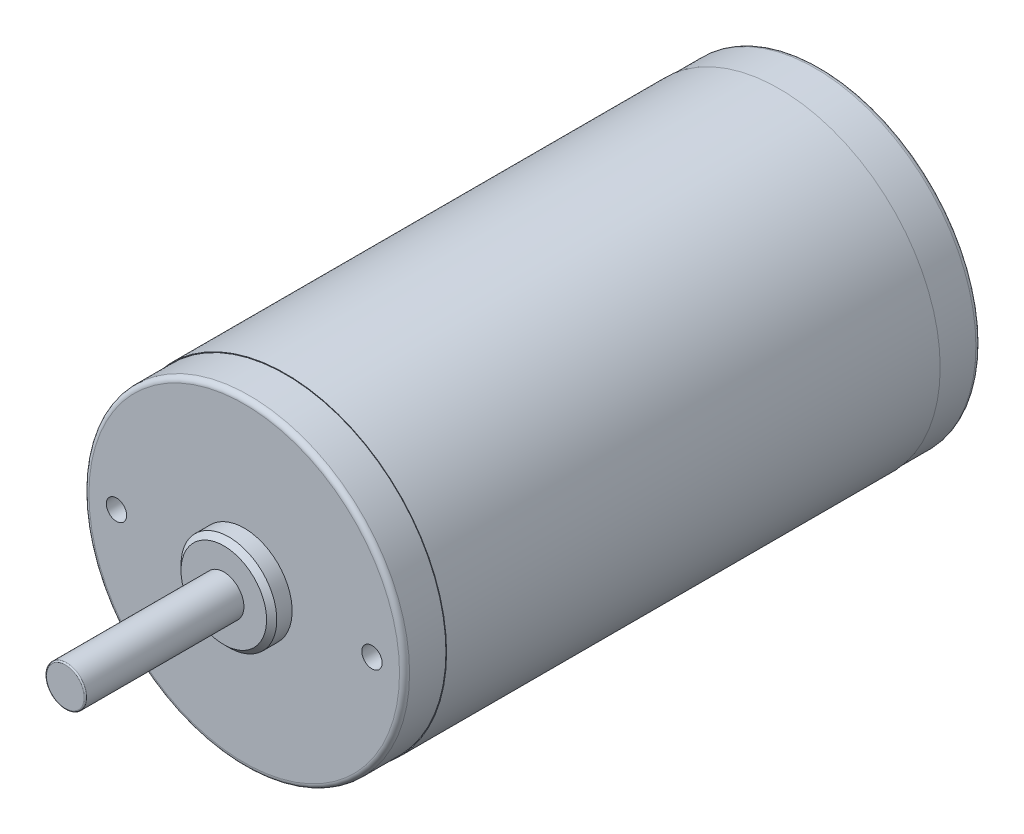
ISO-10303-21;
HEADER;
FILE_DESCRIPTION(('STEP AP214'),'2;1');
FILE_NAME('part.step','',(''),(''),'','','');
FILE_SCHEMA(('AUTOMOTIVE_DESIGN { 1 0 10303 214 1 1 1 1 }'));
ENDSEC;
DATA;
#1=APPLICATION_CONTEXT('core data for automotive mechanical design processes');
#2=APPLICATION_PROTOCOL_DEFINITION('international standard','automotive_design',2000,#1);
#3=PRODUCT_CONTEXT('',#1,'mechanical');
#4=PRODUCT('Part','Part','',(#3));
#5=PRODUCT_RELATED_PRODUCT_CATEGORY('part','',(#4));
#6=PRODUCT_DEFINITION_FORMATION('','',#4);
#7=PRODUCT_DEFINITION_CONTEXT('part definition',#1,'design');
#8=PRODUCT_DEFINITION('design','',#6,#7);
#9=PRODUCT_DEFINITION_SHAPE('','',#8);
#10=(LENGTH_UNIT() NAMED_UNIT(*) SI_UNIT(.MILLI.,.METRE.));
#11=(NAMED_UNIT(*) PLANE_ANGLE_UNIT() SI_UNIT($,.RADIAN.));
#12=(NAMED_UNIT(*) SI_UNIT($,.STERADIAN.) SOLID_ANGLE_UNIT());
#13=UNCERTAINTY_MEASURE_WITH_UNIT(LENGTH_MEASURE(1.E-05),#10,'distance_accuracy_value','');
#14=(GEOMETRIC_REPRESENTATION_CONTEXT(3) GLOBAL_UNCERTAINTY_ASSIGNED_CONTEXT((#13)) GLOBAL_UNIT_ASSIGNED_CONTEXT((#10,
#11,#12)) REPRESENTATION_CONTEXT('',''));
#15=CARTESIAN_POINT('',(0.,0.,0.));
#16=DIRECTION('',(0.,0.,1.));
#17=DIRECTION('',(1.,0.,0.));
#18=AXIS2_PLACEMENT_3D('',#15,#16,#17);
#19=CARTESIAN_POINT('',(35.56,109.2962,54.614));
#20=DIRECTION('',(0.,0.,1.));
#21=DIRECTION('',(1.,0.,0.));
#22=AXIS2_PLACEMENT_3D('',#19,#20,#21);
#23=PLANE('',#22);
#24=CARTESIAN_POINT('',(35.56,109.2962,54.614));
#25=DIRECTION('',(0.,0.,-1.));
#26=DIRECTION('',(-1.,0.,0.));
#27=AXIS2_PLACEMENT_3D('',#24,#25,#26);
#28=CIRCLE('',#27,3.74600000000008);
#29=CARTESIAN_POINT('',(31.8139999999999,109.2962,54.614));
#30=VERTEX_POINT('',#29);
#31=CARTESIAN_POINT('',(39.3060000000001,109.2962,54.614));
#32=VERTEX_POINT('',#31);
#33=EDGE_CURVE('E67',#30,#32,#28,.T.);
#34=ORIENTED_EDGE('',*,*,#33,.F.);
#35=CARTESIAN_POINT('',(35.56,109.2962,54.614));
#36=DIRECTION('',(0.,0.,-1.));
#37=DIRECTION('',(1.,0.,0.));
#38=AXIS2_PLACEMENT_3D('',#35,#36,#37);
#39=CIRCLE('',#38,3.74600000000008);
#40=EDGE_CURVE('E63',#32,#30,#39,.T.);
#41=ORIENTED_EDGE('',*,*,#40,.F.);
#42=EDGE_LOOP('',(#34,#41));
#43=FACE_BOUND('',#42,.T.);
#44=ADVANCED_FACE('F17',(#43),#23,.T.);
#45=CARTESIAN_POINT('',(35.56,109.2962,54.36));
#46=DIRECTION('',(0.,0.,1.));
#47=DIRECTION('',(1.,0.,0.));
#48=AXIS2_PLACEMENT_3D('',#45,#46,#47);
#49=TOROIDAL_SURFACE('',#48,3.74600000000008,0.254);
#50=ORIENTED_EDGE('',*,*,#40,.T.);
#51=ORIENTED_EDGE('',*,*,#33,.T.);
#52=EDGE_LOOP('',(#50,#51));
#53=FACE_BOUND('',#52,.T.);
#54=CARTESIAN_POINT('',(35.56,109.2962,54.36));
#55=DIRECTION('',(0.,0.,-1.));
#56=DIRECTION('',(-1.,0.,0.));
#57=AXIS2_PLACEMENT_3D('',#54,#55,#56);
#58=CIRCLE('',#57,4.00000000000007);
#59=CARTESIAN_POINT('',(31.5599999999999,109.2962,54.36));
#60=VERTEX_POINT('',#59);
#61=EDGE_CURVE('E74',#60,#60,#58,.T.);
#62=ORIENTED_EDGE('',*,*,#61,.F.);
#63=EDGE_LOOP('',(#62));
#64=FACE_BOUND('',#63,.T.);
#65=ADVANCED_FACE('F72',(#53,#64),#49,.T.);
#66=CARTESIAN_POINT('',(35.56,109.2962,54.614));
#67=DIRECTION('',(0.,0.,-1.));
#68=DIRECTION('',(-1.,0.,0.));
#69=AXIS2_PLACEMENT_3D('',#66,#67,#68);
#70=CYLINDRICAL_SURFACE('',#69,4.00000000000007);
#71=CARTESIAN_POINT('',(35.56,109.2962,23.114));
#72=DIRECTION('',(0.,0.,-1.));
#73=DIRECTION('',(-1.,0.,0.));
#74=AXIS2_PLACEMENT_3D('',#71,#72,#73);
#75=CIRCLE('',#74,4.00000000000007);
#76=CARTESIAN_POINT('',(31.5599999999999,109.2962,23.114));
#77=VERTEX_POINT('',#76);
#78=EDGE_CURVE('E104',#77,#77,#75,.T.);
#79=ORIENTED_EDGE('',*,*,#78,.F.);
#80=EDGE_LOOP('',(#79));
#81=FACE_BOUND('',#80,.T.);
#82=ORIENTED_EDGE('',*,*,#61,.T.);
#83=EDGE_LOOP('',(#82));
#84=FACE_BOUND('',#83,.T.);
#85=ADVANCED_FACE('F90',(#81,#84),#70,.T.);
#86=CARTESIAN_POINT('',(35.56,109.2962,23.114));
#87=DIRECTION('',(0.,0.,1.));
#88=DIRECTION('',(1.,0.,0.));
#89=AXIS2_PLACEMENT_3D('',#86,#87,#88);
#90=PLANE('',#89);
#91=ORIENTED_EDGE('',*,*,#78,.T.);
#92=EDGE_LOOP('',(#91));
#93=FACE_BOUND('',#92,.T.);
#94=CARTESIAN_POINT('',(35.56,109.2962,23.114));
#95=DIRECTION('',(0.,0.,-1.));
#96=DIRECTION('',(-1.,0.,0.));
#97=AXIS2_PLACEMENT_3D('',#94,#95,#96);
#98=CIRCLE('',#97,8.50900000182338);
#99=CARTESIAN_POINT('',(27.0509999981766,109.2962,23.114));
#100=VERTEX_POINT('',#99);
#101=EDGE_CURVE('E307',#100,#100,#98,.T.);
#102=ORIENTED_EDGE('',*,*,#101,.F.);
#103=EDGE_LOOP('',(#102));
#104=FACE_BOUND('',#103,.T.);
#105=ADVANCED_FACE('F160',(#93,#104),#90,.T.);
#106=CARTESIAN_POINT('',(35.56,109.2962,-100.317299999998));
#107=DIRECTION('',(0.,0.,-1.));
#108=DIRECTION('',(-1.,0.,0.));
#109=AXIS2_PLACEMENT_3D('',#106,#107,#108);
#110=PLANE('',#109);
#111=CARTESIAN_POINT('',(35.56,109.2962,-100.317299999998));
#112=DIRECTION('',(0.,0.,1.));
#113=DIRECTION('',(1.,0.,0.));
#114=AXIS2_PLACEMENT_3D('',#111,#112,#113);
#115=CIRCLE('',#114,14.0368000000003);
#116=CARTESIAN_POINT('',(49.5968000000003,109.2962,-100.317299999998));
#117=VERTEX_POINT('',#116);
#118=CARTESIAN_POINT('',(21.5231999999997,109.2962,-100.317299999998));
#119=VERTEX_POINT('',#118);
#120=EDGE_CURVE('E142',#117,#119,#115,.T.);
#121=ORIENTED_EDGE('',*,*,#120,.F.);
#122=CARTESIAN_POINT('',(35.56,109.2962,-100.317299999998));
#123=DIRECTION('',(0.,0.,1.));
#124=DIRECTION('',(-1.,0.,0.));
#125=AXIS2_PLACEMENT_3D('',#122,#123,#124);
#126=CIRCLE('',#125,14.0368000000003);
#127=EDGE_CURVE('E310',#119,#117,#126,.T.);
#128=ORIENTED_EDGE('',*,*,#127,.F.);
#129=EDGE_LOOP('',(#121,#128));
#130=FACE_BOUND('',#129,.T.);
#131=ADVANCED_FACE('F150',(#130),#110,.T.);
#132=CARTESIAN_POINT('',(10.1599999999994,109.2962,5.43560000011212));
#133=DIRECTION('',(0.,0.,1.));
#134=DIRECTION('',(1.,0.,0.));
#135=AXIS2_PLACEMENT_3D('',#132,#133,#134);
#136=CONICAL_SURFACE('',#135,2.01930000012817,1.02974425747654);
#137=CARTESIAN_POINT('',(10.1600000000133,109.2962,4.22228214875986));
#138=VERTEX_POINT('',#137);
#139=VERTEX_LOOP('',#138);
#140=FACE_BOUND('',#139,.T.);
#141=CARTESIAN_POINT('',(10.1599999999994,109.2962,5.4356000000007));
#142=DIRECTION('',(0.,0.,1.));
#143=DIRECTION('',(1.,0.,0.));
#144=AXIS2_PLACEMENT_3D('',#141,#142,#143);
#145=CIRCLE('',#144,2.01930000000003);
#146=CARTESIAN_POINT('',(12.1792999999994,109.2962,5.4356000000007));
#147=VERTEX_POINT('',#146);
#148=EDGE_CURVE('E139',#147,#147,#145,.T.);
#149=ORIENTED_EDGE('',*,*,#148,.T.);
#150=EDGE_LOOP('',(#149));
#151=FACE_BOUND('',#150,.T.);
#152=ADVANCED_FACE('F159',(#140,#151),#136,.F.);
#153=CARTESIAN_POINT('',(60.96,109.2962,5.43559999988474));
#154=DIRECTION('',(0.,0.,1.));
#155=DIRECTION('',(1.,0.,0.));
#156=AXIS2_PLACEMENT_3D('',#153,#154,#155);
#157=CONICAL_SURFACE('',#156,2.01929999982444,1.02974425737049);
#158=CARTESIAN_POINT('',(60.9599999997386,109.2962,4.22228214867459));
#159=VERTEX_POINT('',#158);
#160=VERTEX_LOOP('',#159);
#161=FACE_BOUND('',#160,.T.);
#162=CARTESIAN_POINT('',(60.96,109.2962,5.43560000000074));
#163=DIRECTION('',(0.,0.,1.));
#164=DIRECTION('',(1.,0.,0.));
#165=AXIS2_PLACEMENT_3D('',#162,#163,#164);
#166=CIRCLE('',#165,2.01930000000003);
#167=CARTESIAN_POINT('',(62.9793,109.2962,5.43560000000074));
#168=VERTEX_POINT('',#167);
#169=EDGE_CURVE('E136',#168,#168,#166,.T.);
#170=ORIENTED_EDGE('',*,*,#169,.T.);
#171=EDGE_LOOP('',(#170));
#172=FACE_BOUND('',#171,.T.);
#173=ADVANCED_FACE('F363',(#161,#172),#157,.F.);
#174=CARTESIAN_POINT('',(35.56,109.2962,22.0979999999996));
#175=DIRECTION('',(0.,0.,-1.));
#176=DIRECTION('',(-1.,0.,0.));
#177=AXIS2_PLACEMENT_3D('',#174,#175,#176);
#178=CONICAL_SURFACE('',#177,9.52500000000019,0.785398162500005);
#179=CARTESIAN_POINT('',(35.56,109.2962,22.0979999999996));
#180=DIRECTION('',(0.,0.,-1.));
#181=DIRECTION('',(-1.,0.,0.));
#182=AXIS2_PLACEMENT_3D('',#179,#180,#181);
#183=CIRCLE('',#182,9.52500000000019);
#184=CARTESIAN_POINT('',(26.0349999999998,109.2962,22.0979999999996));
#185=VERTEX_POINT('',#184);
#186=EDGE_CURVE('E133',#185,#185,#183,.T.);
#187=ORIENTED_EDGE('',*,*,#186,.F.);
#188=EDGE_LOOP('',(#187));
#189=FACE_BOUND('',#188,.T.);
#190=ORIENTED_EDGE('',*,*,#101,.T.);
#191=EDGE_LOOP('',(#190));
#192=FACE_BOUND('',#191,.T.);
#193=ADVANCED_FACE('F123',(#189,#192),#178,.T.);
#194=CARTESIAN_POINT('',(35.56,109.2962,-99.317299999998));
#195=DIRECTION('',(0.,0.,-1.));
#196=DIRECTION('',(-1.,0.,0.));
#197=AXIS2_PLACEMENT_3D('',#194,#195,#196);
#198=TOROIDAL_SURFACE('',#197,14.0368000000003,1.);
#199=ORIENTED_EDGE('',*,*,#127,.T.);
#200=ORIENTED_EDGE('',*,*,#120,.T.);
#201=EDGE_LOOP('',(#199,#200));
#202=FACE_BOUND('',#201,.T.);
#203=CARTESIAN_POINT('',(35.56,109.2962,-99.317299999998));
#204=DIRECTION('',(0.,0.,1.));
#205=DIRECTION('',(1.,0.,0.));
#206=AXIS2_PLACEMENT_3D('',#203,#204,#205);
#207=CIRCLE('',#206,15.0368000000003);
#208=CARTESIAN_POINT('',(50.5968000000003,109.2962,-99.317299999998));
#209=VERTEX_POINT('',#208);
#210=EDGE_CURVE('E131',#209,#209,#207,.T.);
#211=ORIENTED_EDGE('',*,*,#210,.F.);
#212=EDGE_LOOP('',(#211));
#213=FACE_BOUND('',#212,.T.);
#214=ADVANCED_FACE('F111',(#202,#213),#198,.T.);
#215=CARTESIAN_POINT('',(10.1599999999994,109.2962,19.05));
#216=DIRECTION('',(0.,0.,1.));
#217=DIRECTION('',(1.,0.,0.));
#218=AXIS2_PLACEMENT_3D('',#215,#216,#217);
#219=CYLINDRICAL_SURFACE('',#218,2.01930000000003);
#220=CARTESIAN_POINT('',(10.1599999999994,109.2962,19.05));
#221=DIRECTION('',(0.,0.,1.));
#222=DIRECTION('',(1.,0.,0.));
#223=AXIS2_PLACEMENT_3D('',#220,#221,#222);
#224=CIRCLE('',#223,2.01930000000003);
#225=CARTESIAN_POINT('',(12.1792999999994,109.2962,19.05));
#226=VERTEX_POINT('',#225);
#227=EDGE_CURVE('E304',#226,#226,#224,.F.);
#228=ORIENTED_EDGE('',*,*,#227,.F.);
#229=EDGE_LOOP('',(#228));
#230=FACE_BOUND('',#229,.T.);
#231=ORIENTED_EDGE('',*,*,#148,.F.);
#232=EDGE_LOOP('',(#231));
#233=FACE_BOUND('',#232,.T.);
#234=ADVANCED_FACE('F122',(#230,#233),#219,.F.);
#235=CARTESIAN_POINT('',(60.96,109.2962,19.05));
#236=DIRECTION('',(0.,0.,1.));
#237=DIRECTION('',(1.,0.,0.));
#238=AXIS2_PLACEMENT_3D('',#235,#236,#237);
#239=CYLINDRICAL_SURFACE('',#238,2.01930000000003);
#240=CARTESIAN_POINT('',(60.96,109.2962,19.05));
#241=DIRECTION('',(0.,0.,1.));
#242=DIRECTION('',(1.,0.,0.));
#243=AXIS2_PLACEMENT_3D('',#240,#241,#242);
#244=CIRCLE('',#243,2.01930000000003);
#245=CARTESIAN_POINT('',(62.9793,109.2962,19.05));
#246=VERTEX_POINT('',#245);
#247=EDGE_CURVE('E296',#246,#246,#244,.F.);
#248=ORIENTED_EDGE('',*,*,#247,.F.);
#249=EDGE_LOOP('',(#248));
#250=FACE_BOUND('',#249,.T.);
#251=ORIENTED_EDGE('',*,*,#169,.F.);
#252=EDGE_LOOP('',(#251));
#253=FACE_BOUND('',#252,.T.);
#254=ADVANCED_FACE('F350',(#250,#253),#239,.F.);
#255=CARTESIAN_POINT('',(35.56,109.2962,23.114));
#256=DIRECTION('',(0.,0.,-1.));
#257=DIRECTION('',(-1.,0.,0.));
#258=AXIS2_PLACEMENT_3D('',#255,#256,#257);
#259=CYLINDRICAL_SURFACE('',#258,9.52500000000019);
#260=CARTESIAN_POINT('',(35.56,109.2962,19.05));
#261=DIRECTION('',(0.,0.,-1.));
#262=DIRECTION('',(-1.,0.,0.));
#263=AXIS2_PLACEMENT_3D('',#260,#261,#262);
#264=CIRCLE('',#263,9.52500000000019);
#265=CARTESIAN_POINT('',(26.0349999999998,109.2962,19.05));
#266=VERTEX_POINT('',#265);
#267=EDGE_CURVE('E292',#266,#266,#264,.T.);
#268=ORIENTED_EDGE('',*,*,#267,.F.);
#269=EDGE_LOOP('',(#268));
#270=FACE_BOUND('',#269,.T.);
#271=ORIENTED_EDGE('',*,*,#186,.T.);
#272=EDGE_LOOP('',(#271));
#273=FACE_BOUND('',#272,.T.);
#274=ADVANCED_FACE('F343',(#270,#273),#259,.T.);
#275=CARTESIAN_POINT('',(35.56,109.2962,-100.317299999998));
#276=DIRECTION('',(0.,0.,1.));
#277=DIRECTION('',(1.,0.,0.));
#278=AXIS2_PLACEMENT_3D('',#275,#276,#277);
#279=CYLINDRICAL_SURFACE('',#278,15.0368000000003);
#280=CARTESIAN_POINT('',(35.56,109.2962,-95.554799999998));
#281=DIRECTION('',(0.,0.,1.));
#282=DIRECTION('',(1.,0.,0.));
#283=AXIS2_PLACEMENT_3D('',#280,#281,#282);
#284=CIRCLE('',#283,15.0368000000003);
#285=CARTESIAN_POINT('',(50.5968000000003,109.2962,-95.554799999998));
#286=VERTEX_POINT('',#285);
#287=EDGE_CURVE('E290',#286,#286,#284,.T.);
#288=ORIENTED_EDGE('',*,*,#287,.F.);
#289=EDGE_LOOP('',(#288));
#290=FACE_BOUND('',#289,.T.);
#291=ORIENTED_EDGE('',*,*,#210,.T.);
#292=EDGE_LOOP('',(#291));
#293=FACE_BOUND('',#292,.T.);
#294=ADVANCED_FACE('F341',(#290,#293),#279,.T.);
#295=CARTESIAN_POINT('',(35.56,109.2962,19.05));
#296=DIRECTION('',(0.,0.,1.));
#297=DIRECTION('',(1.,0.,0.));
#298=AXIS2_PLACEMENT_3D('',#295,#296,#297);
#299=PLANE('',#298);
#300=ORIENTED_EDGE('',*,*,#267,.T.);
#301=EDGE_LOOP('',(#300));
#302=FACE_BOUND('',#301,.T.);
#303=ORIENTED_EDGE('',*,*,#247,.T.);
#304=EDGE_LOOP('',(#303));
#305=FACE_BOUND('',#304,.T.);
#306=ORIENTED_EDGE('',*,*,#227,.T.);
#307=EDGE_LOOP('',(#306));
#308=FACE_BOUND('',#307,.T.);
#309=CARTESIAN_POINT('',(35.56,109.2962,19.05));
#310=DIRECTION('',(0.,0.,-1.));
#311=DIRECTION('',(-1.,0.,0.));
#312=AXIS2_PLACEMENT_3D('',#309,#310,#311);
#313=CIRCLE('',#312,30.8770000000005);
#314=CARTESIAN_POINT('',(4.6829999999995,109.2962,19.05));
#315=VERTEX_POINT('',#314);
#316=CARTESIAN_POINT('',(66.4370000000005,109.2962,19.05));
#317=VERTEX_POINT('',#316);
#318=EDGE_CURVE('E261',#315,#317,#313,.T.);
#319=ORIENTED_EDGE('',*,*,#318,.F.);
#320=CARTESIAN_POINT('',(35.56,109.2962,19.05));
#321=DIRECTION('',(0.,0.,-1.));
#322=DIRECTION('',(1.,0.,0.));
#323=AXIS2_PLACEMENT_3D('',#320,#321,#322);
#324=CIRCLE('',#323,30.8770000000005);
#325=EDGE_CURVE('E271',#317,#315,#324,.T.);
#326=ORIENTED_EDGE('',*,*,#325,.F.);
#327=EDGE_LOOP('',(#319,#326));
#328=FACE_BOUND('',#327,.T.);
#329=ADVANCED_FACE('F236',(#302,#305,#308,#328),#299,.T.);
#330=CARTESIAN_POINT('',(35.56,109.2962,-95.554799999998));
#331=DIRECTION('',(0.,0.,-1.));
#332=DIRECTION('',(-1.,0.,0.));
#333=AXIS2_PLACEMENT_3D('',#330,#331,#332);
#334=PLANE('',#333);
#335=ORIENTED_EDGE('',*,*,#287,.T.);
#336=EDGE_LOOP('',(#335));
#337=FACE_BOUND('',#336,.T.);
#338=CARTESIAN_POINT('',(35.56,109.2962,-95.554799999998));
#339=DIRECTION('',(0.,0.,1.));
#340=DIRECTION('',(1.,0.,0.));
#341=AXIS2_PLACEMENT_3D('',#338,#339,#340);
#342=CIRCLE('',#341,30.8770000000005);
#343=CARTESIAN_POINT('',(66.4370000000005,109.2962,-95.554799999998));
#344=VERTEX_POINT('',#343);
#345=CARTESIAN_POINT('',(4.6829999999995,109.2962,-95.554799999998));
#346=VERTEX_POINT('',#345);
#347=EDGE_CURVE('E220',#344,#346,#342,.T.);
#348=ORIENTED_EDGE('',*,*,#347,.F.);
#349=CARTESIAN_POINT('',(35.56,109.2962,-95.554799999998));
#350=DIRECTION('',(0.,0.,1.));
#351=DIRECTION('',(-1.,0.,0.));
#352=AXIS2_PLACEMENT_3D('',#349,#350,#351);
#353=CIRCLE('',#352,30.8770000000005);
#354=EDGE_CURVE('E36',#346,#344,#353,.T.);
#355=ORIENTED_EDGE('',*,*,#354,.F.);
#356=EDGE_LOOP('',(#348,#355));
#357=FACE_BOUND('',#356,.T.);
#358=ADVANCED_FACE('F227',(#337,#357),#334,.T.);
#359=CARTESIAN_POINT('',(35.56,109.2962,18.05));
#360=DIRECTION('',(0.,0.,1.));
#361=DIRECTION('',(1.,0.,0.));
#362=AXIS2_PLACEMENT_3D('',#359,#360,#361);
#363=TOROIDAL_SURFACE('',#362,30.8770000000005,1.);
#364=ORIENTED_EDGE('',*,*,#325,.T.);
#365=ORIENTED_EDGE('',*,*,#318,.T.);
#366=EDGE_LOOP('',(#364,#365));
#367=FACE_BOUND('',#366,.T.);
#368=CARTESIAN_POINT('',(35.56,109.2962,18.05));
#369=DIRECTION('',(0.,0.,-1.));
#370=DIRECTION('',(-1.,0.,0.));
#371=AXIS2_PLACEMENT_3D('',#368,#369,#370);
#372=CIRCLE('',#371,31.8770000000005);
#373=CARTESIAN_POINT('',(3.6829999999995,109.2962,18.05));
#374=VERTEX_POINT('',#373);
#375=EDGE_CURVE('E218',#374,#374,#372,.T.);
#376=ORIENTED_EDGE('',*,*,#375,.F.);
#377=EDGE_LOOP('',(#376));
#378=FACE_BOUND('',#377,.T.);
#379=ADVANCED_FACE('F207',(#367,#378),#363,.T.);
#380=CARTESIAN_POINT('',(35.56,109.2962,-94.554799999998));
#381=DIRECTION('',(0.,0.,-1.));
#382=DIRECTION('',(-1.,0.,0.));
#383=AXIS2_PLACEMENT_3D('',#380,#381,#382);
#384=TOROIDAL_SURFACE('',#383,30.8770000000005,1.);
#385=ORIENTED_EDGE('',*,*,#354,.T.);
#386=ORIENTED_EDGE('',*,*,#347,.T.);
#387=EDGE_LOOP('',(#385,#386));
#388=FACE_BOUND('',#387,.T.);
#389=CARTESIAN_POINT('',(35.56,109.2962,-94.554799999998));
#390=DIRECTION('',(0.,0.,1.));
#391=DIRECTION('',(1.,0.,0.));
#392=AXIS2_PLACEMENT_3D('',#389,#390,#391);
#393=CIRCLE('',#392,31.8770000000005);
#394=CARTESIAN_POINT('',(67.4370000000005,109.2962,-94.554799999998));
#395=VERTEX_POINT('',#394);
#396=EDGE_CURVE('E217',#395,#395,#393,.T.);
#397=ORIENTED_EDGE('',*,*,#396,.F.);
#398=EDGE_LOOP('',(#397));
#399=FACE_BOUND('',#398,.T.);
#400=ADVANCED_FACE('F201',(#388,#399),#384,.T.);
#401=CARTESIAN_POINT('',(35.56,109.2962,19.05));
#402=DIRECTION('',(0.,0.,-1.));
#403=DIRECTION('',(-1.,0.,0.));
#404=AXIS2_PLACEMENT_3D('',#401,#402,#403);
#405=CYLINDRICAL_SURFACE('',#404,31.8770000000005);
#406=CARTESIAN_POINT('',(35.56,109.2962,10.8204000000007));
#407=DIRECTION('',(0.,0.,-1.));
#408=DIRECTION('',(-1.,0.,0.));
#409=AXIS2_PLACEMENT_3D('',#406,#407,#408);
#410=CIRCLE('',#409,31.8770000000005);
#411=CARTESIAN_POINT('',(3.6829999999995,109.2962,10.8204000000007));
#412=VERTEX_POINT('',#411);
#413=EDGE_CURVE('E299',#412,#412,#410,.T.);
#414=ORIENTED_EDGE('',*,*,#413,.F.);
#415=EDGE_LOOP('',(#414));
#416=FACE_BOUND('',#415,.T.);
#417=ORIENTED_EDGE('',*,*,#375,.T.);
#418=EDGE_LOOP('',(#417));
#419=FACE_BOUND('',#418,.T.);
#420=ADVANCED_FACE('F197',(#416,#419),#405,.T.);
#421=CARTESIAN_POINT('',(35.56,109.2962,-95.554799999998));
#422=DIRECTION('',(0.,0.,1.));
#423=DIRECTION('',(1.,0.,0.));
#424=AXIS2_PLACEMENT_3D('',#421,#422,#423);
#425=CYLINDRICAL_SURFACE('',#424,31.8770000000005);
#426=CARTESIAN_POINT('',(35.56,109.2962,-87.325199999998));
#427=DIRECTION('',(0.,0.,1.));
#428=DIRECTION('',(1.,0.,0.));
#429=AXIS2_PLACEMENT_3D('',#426,#427,#428);
#430=CIRCLE('',#429,31.8770000000005);
#431=CARTESIAN_POINT('',(67.4370000000005,109.2962,-87.325199999998));
#432=VERTEX_POINT('',#431);
#433=EDGE_CURVE('E524',#432,#432,#430,.T.);
#434=ORIENTED_EDGE('',*,*,#433,.F.);
#435=EDGE_LOOP('',(#434));
#436=FACE_BOUND('',#435,.T.);
#437=ORIENTED_EDGE('',*,*,#396,.T.);
#438=EDGE_LOOP('',(#437));
#439=FACE_BOUND('',#438,.T.);
#440=ADVANCED_FACE('F193',(#436,#439),#425,.T.);
#441=CARTESIAN_POINT('',(67.5640000000005,109.2962,10.8204000000007));
#442=DIRECTION('',(0.,0.,1.));
#443=DIRECTION('',(1.,0.,0.));
#444=AXIS2_PLACEMENT_3D('',#441,#442,#443);
#445=PLANE('',#444);
#446=ORIENTED_EDGE('',*,*,#413,.T.);
#447=EDGE_LOOP('',(#446));
#448=FACE_BOUND('',#447,.T.);
#449=CARTESIAN_POINT('',(35.56,109.2962,10.8204000000007));
#450=DIRECTION('',(0.,0.,-1.));
#451=DIRECTION('',(-1.,0.,0.));
#452=AXIS2_PLACEMENT_3D('',#449,#450,#451);
#453=CIRCLE('',#452,32.0040000000005);
#454=CARTESIAN_POINT('',(3.5559999999995,109.2962,10.8204000000007));
#455=VERTEX_POINT('',#454);
#456=EDGE_CURVE('E28',#455,#455,#453,.T.);
#457=ORIENTED_EDGE('',*,*,#456,.F.);
#458=EDGE_LOOP('',(#457));
#459=FACE_BOUND('',#458,.T.);
#460=ADVANCED_FACE('F186',(#448,#459),#445,.T.);
#461=CARTESIAN_POINT('',(35.56,109.2962,-87.325199999998));
#462=DIRECTION('',(0.,0.,-1.));
#463=DIRECTION('',(-1.,0.,0.));
#464=AXIS2_PLACEMENT_3D('',#461,#462,#463);
#465=PLANE('',#464);
#466=ORIENTED_EDGE('',*,*,#433,.T.);
#467=EDGE_LOOP('',(#466));
#468=FACE_BOUND('',#467,.T.);
#469=CARTESIAN_POINT('',(35.56,109.2962,-87.325199999998));
#470=DIRECTION('',(0.,0.,-1.));
#471=DIRECTION('',(-1.,0.,0.));
#472=AXIS2_PLACEMENT_3D('',#469,#470,#471);
#473=CIRCLE('',#472,32.0040000000005);
#474=CARTESIAN_POINT('',(3.5559999999995,109.2962,-87.325199999998));
#475=VERTEX_POINT('',#474);
#476=EDGE_CURVE('E11',#475,#475,#473,.F.);
#477=ORIENTED_EDGE('',*,*,#476,.F.);
#478=EDGE_LOOP('',(#477));
#479=FACE_BOUND('',#478,.T.);
#480=ADVANCED_FACE('F180',(#468,#479),#465,.T.);
#481=CARTESIAN_POINT('',(35.56,109.2962,10.8204000000007));
#482=DIRECTION('',(0.,0.,-1.));
#483=DIRECTION('',(-1.,0.,0.));
#484=AXIS2_PLACEMENT_3D('',#481,#482,#483);
#485=CYLINDRICAL_SURFACE('',#484,32.0040000000005);
#486=ORIENTED_EDGE('',*,*,#476,.T.);
#487=EDGE_LOOP('',(#486));
#488=FACE_BOUND('',#487,.T.);
#489=ORIENTED_EDGE('',*,*,#456,.T.);
#490=EDGE_LOOP('',(#489));
#491=FACE_BOUND('',#490,.T.);
#492=ADVANCED_FACE('F178',(#488,#491),#485,.T.);
#493=CLOSED_SHELL('',(#44,#65,#85,#105,#131,#152,#173,#193,#214,#234,#254,#274,#294,#329,#358,
#379,#400,#420,#440,#460,#480,#492));
#494=MANIFOLD_SOLID_BREP('B1',#493);
#495=ADVANCED_BREP_SHAPE_REPRESENTATION('',(#18,#494),#14);
#496=SHAPE_DEFINITION_REPRESENTATION(#9,#495);
ENDSEC;
END-ISO-10303-21;
